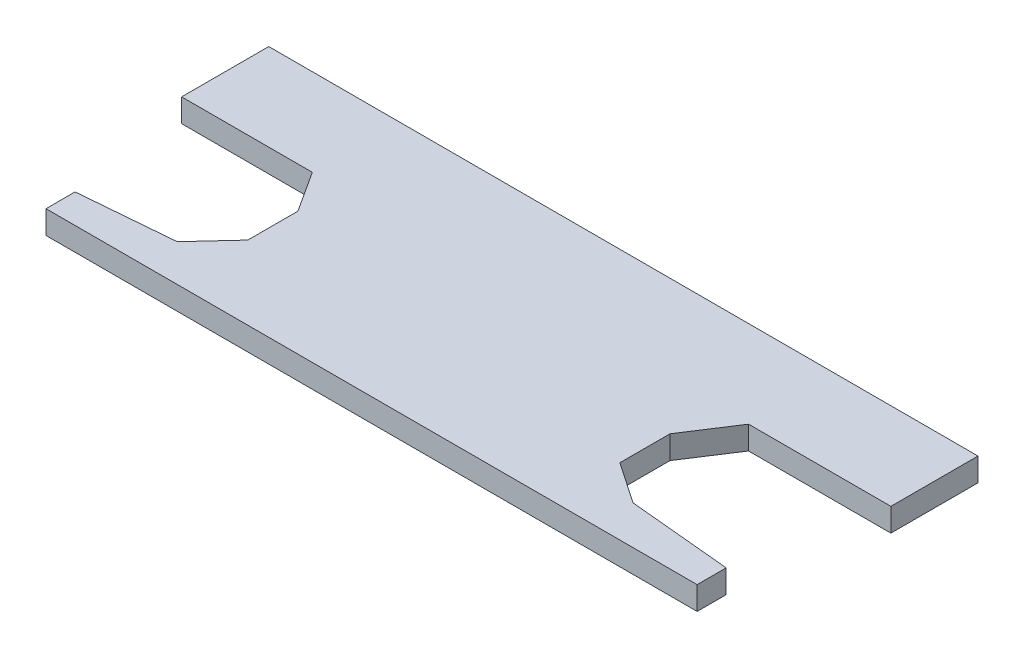
ISO-10303-21;
HEADER;
FILE_DESCRIPTION(('STEP AP214'),'2;1');
FILE_NAME('part.step','',(''),(''),'','','');
FILE_SCHEMA(('AUTOMOTIVE_DESIGN { 1 0 10303 214 1 1 1 1 }'));
ENDSEC;
DATA;
#1=APPLICATION_CONTEXT('core data for automotive mechanical design processes');
#2=APPLICATION_PROTOCOL_DEFINITION('international standard','automotive_design',2000,#1);
#3=PRODUCT_CONTEXT('',#1,'mechanical');
#4=PRODUCT('Part','Part','',(#3));
#5=PRODUCT_RELATED_PRODUCT_CATEGORY('part','',(#4));
#6=PRODUCT_DEFINITION_FORMATION('','',#4);
#7=PRODUCT_DEFINITION_CONTEXT('part definition',#1,'design');
#8=PRODUCT_DEFINITION('design','',#6,#7);
#9=PRODUCT_DEFINITION_SHAPE('','',#8);
#10=(LENGTH_UNIT() NAMED_UNIT(*) SI_UNIT(.MILLI.,.METRE.));
#11=(NAMED_UNIT(*) PLANE_ANGLE_UNIT() SI_UNIT($,.RADIAN.));
#12=(NAMED_UNIT(*) SI_UNIT($,.STERADIAN.) SOLID_ANGLE_UNIT());
#13=UNCERTAINTY_MEASURE_WITH_UNIT(LENGTH_MEASURE(1.E-05),#10,'distance_accuracy_value','');
#14=(GEOMETRIC_REPRESENTATION_CONTEXT(3) GLOBAL_UNCERTAINTY_ASSIGNED_CONTEXT((#13)) GLOBAL_UNIT_ASSIGNED_CONTEXT((#10,
#11,#12)) REPRESENTATION_CONTEXT('',''));
#15=CARTESIAN_POINT('',(0.,0.,0.));
#16=DIRECTION('',(0.,0.,1.));
#17=DIRECTION('',(1.,0.,0.));
#18=AXIS2_PLACEMENT_3D('',#15,#16,#17);
#19=CARTESIAN_POINT('',(0.,1.6,0.));
#20=DIRECTION('',(1.,0.,0.));
#21=DIRECTION('',(0.,0.,-1.));
#22=AXIS2_PLACEMENT_3D('',#19,#20,#21);
#23=PLANE('',#22);
#24=DIRECTION('',(0.,1.,0.));
#25=VECTOR('',#24,1.);
#26=CARTESIAN_POINT('',(0.,0.,-11.34));
#27=LINE('',#26,#25);
#28=CARTESIAN_POINT('',(0.,0.,-11.34));
#29=VERTEX_POINT('',#28);
#30=CARTESIAN_POINT('',(0.,1.6,-11.34));
#31=VERTEX_POINT('',#30);
#32=EDGE_CURVE('E194',#29,#31,#27,.T.);
#33=ORIENTED_EDGE('',*,*,#32,.T.);
#34=DIRECTION('',(0.,0.,1.));
#35=VECTOR('',#34,1.);
#36=CARTESIAN_POINT('',(0.,1.6,0.));
#37=LINE('',#36,#35);
#38=CARTESIAN_POINT('',(0.,1.6,-17.34));
#39=VERTEX_POINT('',#38);
#40=EDGE_CURVE('E252',#39,#31,#37,.T.);
#41=ORIENTED_EDGE('',*,*,#40,.F.);
#42=DIRECTION('',(0.,-1.,0.));
#43=VECTOR('',#42,1.);
#44=CARTESIAN_POINT('',(0.,1.6,-17.34));
#45=LINE('',#44,#43);
#46=CARTESIAN_POINT('',(0.,0.,-17.34));
#47=VERTEX_POINT('',#46);
#48=EDGE_CURVE('E41',#39,#47,#45,.T.);
#49=ORIENTED_EDGE('',*,*,#48,.T.);
#50=DIRECTION('',(0.,0.,1.));
#51=VECTOR('',#50,1.);
#52=CARTESIAN_POINT('',(0.,0.,0.));
#53=LINE('',#52,#51);
#54=EDGE_CURVE('E240',#47,#29,#53,.T.);
#55=ORIENTED_EDGE('',*,*,#54,.T.);
#56=EDGE_LOOP('',(#33,#41,#49,#55));
#57=FACE_BOUND('',#56,.T.);
#58=ADVANCED_FACE('F34',(#57),#23,.F.);
#59=CARTESIAN_POINT('',(0.,1.6,0.));
#60=DIRECTION('',(0.,0.,-1.));
#61=DIRECTION('',(-1.,0.,0.));
#62=AXIS2_PLACEMENT_3D('',#59,#60,#61);
#63=PLANE('',#62);
#64=DIRECTION('',(1.,0.,0.));
#65=VECTOR('',#64,1.);
#66=CARTESIAN_POINT('',(0.,1.6,0.));
#67=LINE('',#66,#65);
#68=CARTESIAN_POINT('',(2.,1.6,0.));
#69=VERTEX_POINT('',#68);
#70=CARTESIAN_POINT('',(46.84,1.6,0.));
#71=VERTEX_POINT('',#70);
#72=EDGE_CURVE('E255',#69,#71,#67,.T.);
#73=ORIENTED_EDGE('',*,*,#72,.F.);
#74=DIRECTION('',(0.,1.,0.));
#75=VECTOR('',#74,1.);
#76=CARTESIAN_POINT('',(2.,0.,0.));
#77=LINE('',#76,#75);
#78=CARTESIAN_POINT('',(2.,0.,0.));
#79=VERTEX_POINT('',#78);
#80=EDGE_CURVE('E191',#79,#69,#77,.T.);
#81=ORIENTED_EDGE('',*,*,#80,.F.);
#82=DIRECTION('',(1.,0.,0.));
#83=VECTOR('',#82,1.);
#84=CARTESIAN_POINT('',(0.,0.,0.));
#85=LINE('',#84,#83);
#86=CARTESIAN_POINT('',(46.84,0.,0.));
#87=VERTEX_POINT('',#86);
#88=EDGE_CURVE('E167',#79,#87,#85,.T.);
#89=ORIENTED_EDGE('',*,*,#88,.T.);
#90=DIRECTION('',(0.,1.,0.));
#91=VECTOR('',#90,1.);
#92=CARTESIAN_POINT('',(46.84,0.,0.));
#93=LINE('',#92,#91);
#94=EDGE_CURVE('E247',#87,#71,#93,.T.);
#95=ORIENTED_EDGE('',*,*,#94,.T.);
#96=EDGE_LOOP('',(#73,#81,#89,#95));
#97=FACE_BOUND('',#96,.T.);
#98=ADVANCED_FACE('F324',(#97),#63,.F.);
#99=CARTESIAN_POINT('',(48.84,1.6,0.));
#100=DIRECTION('',(-1.,0.,0.));
#101=DIRECTION('',(0.,0.,1.));
#102=AXIS2_PLACEMENT_3D('',#99,#100,#101);
#103=PLANE('',#102);
#104=DIRECTION('',(0.,0.,-1.));
#105=VECTOR('',#104,1.);
#106=CARTESIAN_POINT('',(48.84,1.6,0.));
#107=LINE('',#106,#105);
#108=CARTESIAN_POINT('',(48.84,1.6,-11.34));
#109=VERTEX_POINT('',#108);
#110=CARTESIAN_POINT('',(48.84,1.6,-17.34));
#111=VERTEX_POINT('',#110);
#112=EDGE_CURVE('E258',#109,#111,#107,.T.);
#113=ORIENTED_EDGE('',*,*,#112,.F.);
#114=DIRECTION('',(0.,1.,0.));
#115=VECTOR('',#114,1.);
#116=CARTESIAN_POINT('',(48.84,0.,-11.34));
#117=LINE('',#116,#115);
#118=CARTESIAN_POINT('',(48.84,0.,-11.34));
#119=VERTEX_POINT('',#118);
#120=EDGE_CURVE('E245',#119,#109,#117,.T.);
#121=ORIENTED_EDGE('',*,*,#120,.F.);
#122=DIRECTION('',(0.,0.,-1.));
#123=VECTOR('',#122,1.);
#124=CARTESIAN_POINT('',(48.84,0.,0.));
#125=LINE('',#124,#123);
#126=CARTESIAN_POINT('',(48.84,0.,-17.34));
#127=VERTEX_POINT('',#126);
#128=EDGE_CURVE('E265',#119,#127,#125,.T.);
#129=ORIENTED_EDGE('',*,*,#128,.T.);
#130=DIRECTION('',(0.,-1.,0.));
#131=VECTOR('',#130,1.);
#132=CARTESIAN_POINT('',(48.84,1.6,-17.34));
#133=LINE('',#132,#131);
#134=EDGE_CURVE('E11',#111,#127,#133,.T.);
#135=ORIENTED_EDGE('',*,*,#134,.F.);
#136=EDGE_LOOP('',(#113,#121,#129,#135));
#137=FACE_BOUND('',#136,.T.);
#138=ADVANCED_FACE('F294',(#137),#103,.F.);
#139=CARTESIAN_POINT('',(0.,1.6,-17.34));
#140=DIRECTION('',(0.,0.,1.));
#141=DIRECTION('',(1.,0.,0.));
#142=AXIS2_PLACEMENT_3D('',#139,#140,#141);
#143=PLANE('',#142);
#144=DIRECTION('',(-1.,0.,0.));
#145=VECTOR('',#144,1.);
#146=CARTESIAN_POINT('',(0.,0.,-17.34));
#147=LINE('',#146,#145);
#148=EDGE_CURVE('E256',#127,#47,#147,.T.);
#149=ORIENTED_EDGE('',*,*,#148,.T.);
#150=ORIENTED_EDGE('',*,*,#48,.F.);
#151=DIRECTION('',(-1.,0.,0.));
#152=VECTOR('',#151,1.);
#153=CARTESIAN_POINT('',(0.,1.6,-17.34));
#154=LINE('',#153,#152);
#155=EDGE_CURVE('E260',#111,#39,#154,.T.);
#156=ORIENTED_EDGE('',*,*,#155,.F.);
#157=ORIENTED_EDGE('',*,*,#134,.T.);
#158=EDGE_LOOP('',(#149,#150,#156,#157));
#159=FACE_BOUND('',#158,.T.);
#160=ADVANCED_FACE('F292',(#159),#143,.F.);
#161=CARTESIAN_POINT('',(0.,1.6,0.));
#162=DIRECTION('',(0.,-1.,0.));
#163=DIRECTION('',(0.,0.,-1.));
#164=AXIS2_PLACEMENT_3D('',#161,#162,#163);
#165=PLANE('',#164);
#166=DIRECTION('',(0.996424453394045,0.,-0.0844885121089164));
#167=VECTOR('',#166,1.);
#168=CARTESIAN_POINT('',(-0.154096221635649,1.6,-1.81735054365084));
#169=LINE('',#168,#167);
#170=CARTESIAN_POINT('',(2.,1.6,-2.));
#171=VERTEX_POINT('',#170);
#172=CARTESIAN_POINT('',(8.48648479760467,1.6,-2.55));
#173=VERTEX_POINT('',#172);
#174=EDGE_CURVE('E181',#171,#173,#169,.T.);
#175=ORIENTED_EDGE('',*,*,#174,.F.);
#176=DIRECTION('',(0.,0.,-1.));
#177=VECTOR('',#176,1.);
#178=CARTESIAN_POINT('',(2.,1.6,0.));
#179=LINE('',#178,#177);
#180=EDGE_CURVE('E153',#69,#171,#179,.T.);
#181=ORIENTED_EDGE('',*,*,#180,.F.);
#182=ORIENTED_EDGE('',*,*,#72,.T.);
#183=DIRECTION('',(0.,0.,-1.));
#184=VECTOR('',#183,1.);
#185=CARTESIAN_POINT('',(46.84,1.6,0.));
#186=LINE('',#185,#184);
#187=CARTESIAN_POINT('',(46.84,1.6,-2.));
#188=VERTEX_POINT('',#187);
#189=EDGE_CURVE('E227',#71,#188,#186,.T.);
#190=ORIENTED_EDGE('',*,*,#189,.T.);
#191=DIRECTION('',(0.995564595406087,0.,0.0940804781764742));
#192=VECTOR('',#191,1.);
#193=CARTESIAN_POINT('',(0.601913614136878,1.6,-6.36948169633607));
#194=LINE('',#193,#192);
#195=CARTESIAN_POINT('',(39.7500245677867,1.6,-2.67));
#196=VERTEX_POINT('',#195);
#197=EDGE_CURVE('E225',#196,#188,#194,.T.);
#198=ORIENTED_EDGE('',*,*,#197,.F.);
#199=DIRECTION('',(0.825588537147306,0.,0.564272600195129));
#200=VECTOR('',#199,1.);
#201=CARTESIAN_POINT('',(13.9003877886386,1.6,-20.3376892945608));
#202=LINE('',#201,#200);
#203=CARTESIAN_POINT('',(36.91,1.6,-4.61109774467124));
#204=VERTEX_POINT('',#203);
#205=EDGE_CURVE('E193',#204,#196,#202,.T.);
#206=ORIENTED_EDGE('',*,*,#205,.F.);
#207=DIRECTION('',(0.,0.,1.));
#208=VECTOR('',#207,1.);
#209=CARTESIAN_POINT('',(36.91,1.6,0.));
#210=LINE('',#209,#208);
#211=CARTESIAN_POINT('',(36.91,1.6,-8.06109774467124));
#212=VERTEX_POINT('',#211);
#213=EDGE_CURVE('E208',#212,#204,#210,.T.);
#214=ORIENTED_EDGE('',*,*,#213,.F.);
#215=DIRECTION('',(-0.544757033248082,0.,0.838593927194055));
#216=VECTOR('',#215,1.);
#217=CARTESIAN_POINT('',(22.2740292871147,1.6,14.469379898242));
#218=LINE('',#217,#216);
#219=CARTESIAN_POINT('',(39.04,1.6,-11.34));
#220=VERTEX_POINT('',#219);
#221=EDGE_CURVE('E233',#220,#212,#218,.T.);
#222=ORIENTED_EDGE('',*,*,#221,.F.);
#223=DIRECTION('',(-1.,0.,0.));
#224=VECTOR('',#223,1.);
#225=CARTESIAN_POINT('',(0.,1.6,-11.34));
#226=LINE('',#225,#224);
#227=EDGE_CURVE('E230',#109,#220,#226,.T.);
#228=ORIENTED_EDGE('',*,*,#227,.F.);
#229=ORIENTED_EDGE('',*,*,#112,.T.);
#230=ORIENTED_EDGE('',*,*,#155,.T.);
#231=ORIENTED_EDGE('',*,*,#40,.T.);
#232=DIRECTION('',(1.,0.,0.));
#233=VECTOR('',#232,1.);
#234=CARTESIAN_POINT('',(0.,1.6,-11.34));
#235=LINE('',#234,#233);
#236=CARTESIAN_POINT('',(9.,1.6,-11.34));
#237=VERTEX_POINT('',#236);
#238=EDGE_CURVE('E168',#31,#237,#235,.T.);
#239=ORIENTED_EDGE('',*,*,#238,.T.);
#240=DIRECTION('',(0.543283582089552,0.,0.839549253726036));
#241=VECTOR('',#240,1.);
#242=CARTESIAN_POINT('',(11.515911660649,1.6,-7.45210088658577));
#243=LINE('',#242,#241);
#244=CARTESIAN_POINT('',(10.82,1.6,-8.52751000001778));
#245=VERTEX_POINT('',#244);
#246=EDGE_CURVE('E171',#237,#245,#243,.T.);
#247=ORIENTED_EDGE('',*,*,#246,.T.);
#248=DIRECTION('',(0.,0.,1.));
#249=VECTOR('',#248,1.);
#250=CARTESIAN_POINT('',(10.82,1.6,0.));
#251=LINE('',#250,#249);
#252=CARTESIAN_POINT('',(10.82,1.6,-5.07751000001778));
#253=VERTEX_POINT('',#252);
#254=EDGE_CURVE('E186',#245,#253,#251,.T.);
#255=ORIENTED_EDGE('',*,*,#254,.T.);
#256=DIRECTION('',(-0.678347442556782,0.,0.734741279074936));
#257=VECTOR('',#256,1.);
#258=CARTESIAN_POINT('',(3.31043907759805,1.6,3.0563518696758));
#259=LINE('',#258,#257);
#260=EDGE_CURVE('E183',#253,#173,#259,.T.);
#261=ORIENTED_EDGE('',*,*,#260,.T.);
#262=EDGE_LOOP('',(#175,#181,#182,#190,#198,#206,#214,#222,#228,#229,#230,#231,#239,#247,#255,#261));
#263=FACE_BOUND('',#262,.T.);
#264=ADVANCED_FACE('F288',(#263),#165,.F.);
#265=CARTESIAN_POINT('',(0.,0.,0.));
#266=DIRECTION('',(0.,-1.,0.));
#267=DIRECTION('',(0.,0.,-1.));
#268=AXIS2_PLACEMENT_3D('',#265,#266,#267);
#269=PLANE('',#268);
#270=DIRECTION('',(0.,0.,-1.));
#271=VECTOR('',#270,1.);
#272=CARTESIAN_POINT('',(2.,0.,0.));
#273=LINE('',#272,#271);
#274=CARTESIAN_POINT('',(2.,0.,-2.));
#275=VERTEX_POINT('',#274);
#276=EDGE_CURVE('E150',#79,#275,#273,.T.);
#277=ORIENTED_EDGE('',*,*,#276,.T.);
#278=DIRECTION('',(0.996424453394045,0.,-0.0844885121089164));
#279=VECTOR('',#278,1.);
#280=CARTESIAN_POINT('',(-0.154096221635649,0.,-1.81735054365084));
#281=LINE('',#280,#279);
#282=CARTESIAN_POINT('',(8.48648479760467,0.,-2.55));
#283=VERTEX_POINT('',#282);
#284=EDGE_CURVE('E158',#275,#283,#281,.T.);
#285=ORIENTED_EDGE('',*,*,#284,.T.);
#286=DIRECTION('',(-0.678347442556782,0.,0.734741279074936));
#287=VECTOR('',#286,1.);
#288=CARTESIAN_POINT('',(3.31043907759805,0.,3.0563518696758));
#289=LINE('',#288,#287);
#290=CARTESIAN_POINT('',(10.82,0.,-5.07751000001778));
#291=VERTEX_POINT('',#290);
#292=EDGE_CURVE('E162',#291,#283,#289,.T.);
#293=ORIENTED_EDGE('',*,*,#292,.F.);
#294=DIRECTION('',(0.,0.,1.));
#295=VECTOR('',#294,1.);
#296=CARTESIAN_POINT('',(10.82,0.,0.));
#297=LINE('',#296,#295);
#298=CARTESIAN_POINT('',(10.82,0.,-8.52751000001778));
#299=VERTEX_POINT('',#298);
#300=EDGE_CURVE('E175',#299,#291,#297,.T.);
#301=ORIENTED_EDGE('',*,*,#300,.F.);
#302=DIRECTION('',(0.543283582089552,0.,0.839549253726036));
#303=VECTOR('',#302,1.);
#304=CARTESIAN_POINT('',(11.515911660649,0.,-7.45210088658577));
#305=LINE('',#304,#303);
#306=CARTESIAN_POINT('',(9.,0.,-11.34));
#307=VERTEX_POINT('',#306);
#308=EDGE_CURVE('E177',#307,#299,#305,.T.);
#309=ORIENTED_EDGE('',*,*,#308,.F.);
#310=DIRECTION('',(1.,0.,0.));
#311=VECTOR('',#310,1.);
#312=CARTESIAN_POINT('',(0.,0.,-11.34));
#313=LINE('',#312,#311);
#314=EDGE_CURVE('E155',#29,#307,#313,.T.);
#315=ORIENTED_EDGE('',*,*,#314,.F.);
#316=ORIENTED_EDGE('',*,*,#54,.F.);
#317=ORIENTED_EDGE('',*,*,#148,.F.);
#318=ORIENTED_EDGE('',*,*,#128,.F.);
#319=DIRECTION('',(-1.,0.,0.));
#320=VECTOR('',#319,1.);
#321=CARTESIAN_POINT('',(0.,0.,-11.34));
#322=LINE('',#321,#320);
#323=CARTESIAN_POINT('',(39.04,0.,-11.34));
#324=VERTEX_POINT('',#323);
#325=EDGE_CURVE('E213',#119,#324,#322,.T.);
#326=ORIENTED_EDGE('',*,*,#325,.T.);
#327=DIRECTION('',(-0.544757033248082,0.,0.838593927194055));
#328=VECTOR('',#327,1.);
#329=CARTESIAN_POINT('',(22.2740292871147,0.,14.469379898242));
#330=LINE('',#329,#328);
#331=CARTESIAN_POINT('',(36.91,0.,-8.06109774467124));
#332=VERTEX_POINT('',#331);
#333=EDGE_CURVE('E216',#324,#332,#330,.T.);
#334=ORIENTED_EDGE('',*,*,#333,.T.);
#335=DIRECTION('',(0.,0.,1.));
#336=VECTOR('',#335,1.);
#337=CARTESIAN_POINT('',(36.91,0.,0.));
#338=LINE('',#337,#336);
#339=CARTESIAN_POINT('',(36.91,0.,-4.61109774467124));
#340=VERTEX_POINT('',#339);
#341=EDGE_CURVE('E219',#332,#340,#338,.T.);
#342=ORIENTED_EDGE('',*,*,#341,.T.);
#343=DIRECTION('',(0.825588537147306,0.,0.564272600195129));
#344=VECTOR('',#343,1.);
#345=CARTESIAN_POINT('',(13.9003877886386,0.,-20.3376892945608));
#346=LINE('',#345,#344);
#347=CARTESIAN_POINT('',(39.7500245677867,0.,-2.67));
#348=VERTEX_POINT('',#347);
#349=EDGE_CURVE('E204',#340,#348,#346,.T.);
#350=ORIENTED_EDGE('',*,*,#349,.T.);
#351=DIRECTION('',(0.995564595406087,0.,0.0940804781764742));
#352=VECTOR('',#351,1.);
#353=CARTESIAN_POINT('',(0.601913614136878,0.,-6.36948169633607));
#354=LINE('',#353,#352);
#355=CARTESIAN_POINT('',(46.84,0.,-2.));
#356=VERTEX_POINT('',#355);
#357=EDGE_CURVE('E207',#348,#356,#354,.T.);
#358=ORIENTED_EDGE('',*,*,#357,.T.);
#359=DIRECTION('',(0.,0.,-1.));
#360=VECTOR('',#359,1.);
#361=CARTESIAN_POINT('',(46.84,0.,0.));
#362=LINE('',#361,#360);
#363=EDGE_CURVE('E211',#87,#356,#362,.T.);
#364=ORIENTED_EDGE('',*,*,#363,.F.);
#365=ORIENTED_EDGE('',*,*,#88,.F.);
#366=EDGE_LOOP('',(#277,#285,#293,#301,#309,#315,#316,#317,#318,#326,#334,#342,#350,#358,#364,#365));
#367=FACE_BOUND('',#366,.T.);
#368=ADVANCED_FACE('F165',(#367),#269,.T.);
#369=CARTESIAN_POINT('',(13.9003877886386,0.,-20.3376892945608));
#370=DIRECTION('',(-0.564272600195129,0.,0.825588537147305));
#371=DIRECTION('',(0.825588537147306,0.,0.564272600195129));
#372=AXIS2_PLACEMENT_3D('',#369,#370,#371);
#373=PLANE('',#372);
#374=ORIENTED_EDGE('',*,*,#205,.T.);
#375=DIRECTION('',(0.,1.,0.));
#376=VECTOR('',#375,1.);
#377=CARTESIAN_POINT('',(39.7500245677867,0.,-2.67));
#378=LINE('',#377,#376);
#379=EDGE_CURVE('E222',#348,#196,#378,.T.);
#380=ORIENTED_EDGE('',*,*,#379,.F.);
#381=ORIENTED_EDGE('',*,*,#349,.F.);
#382=DIRECTION('',(0.,1.,0.));
#383=VECTOR('',#382,1.);
#384=CARTESIAN_POINT('',(36.91,0.,-4.61109774467124));
#385=LINE('',#384,#383);
#386=EDGE_CURVE('E238',#340,#204,#385,.T.);
#387=ORIENTED_EDGE('',*,*,#386,.T.);
#388=EDGE_LOOP('',(#374,#380,#381,#387));
#389=FACE_BOUND('',#388,.T.);
#390=ADVANCED_FACE('F308',(#389),#373,.F.);
#391=CARTESIAN_POINT('',(36.91,0.,0.));
#392=DIRECTION('',(-1.,0.,0.));
#393=DIRECTION('',(0.,0.,1.));
#394=AXIS2_PLACEMENT_3D('',#391,#392,#393);
#395=PLANE('',#394);
#396=ORIENTED_EDGE('',*,*,#213,.T.);
#397=ORIENTED_EDGE('',*,*,#386,.F.);
#398=ORIENTED_EDGE('',*,*,#341,.F.);
#399=DIRECTION('',(0.,1.,0.));
#400=VECTOR('',#399,1.);
#401=CARTESIAN_POINT('',(36.91,0.,-8.06109774467124));
#402=LINE('',#401,#400);
#403=EDGE_CURVE('E241',#332,#212,#402,.T.);
#404=ORIENTED_EDGE('',*,*,#403,.T.);
#405=EDGE_LOOP('',(#396,#397,#398,#404));
#406=FACE_BOUND('',#405,.T.);
#407=ADVANCED_FACE('F305',(#406),#395,.F.);
#408=CARTESIAN_POINT('',(22.2740292871147,0.,14.469379898242));
#409=DIRECTION('',(-0.838593927194055,0.,-0.544757033248082));
#410=DIRECTION('',(-0.544757033248082,0.,0.838593927194055));
#411=AXIS2_PLACEMENT_3D('',#408,#409,#410);
#412=PLANE('',#411);
#413=ORIENTED_EDGE('',*,*,#221,.T.);
#414=ORIENTED_EDGE('',*,*,#403,.F.);
#415=ORIENTED_EDGE('',*,*,#333,.F.);
#416=DIRECTION('',(0.,1.,0.));
#417=VECTOR('',#416,1.);
#418=CARTESIAN_POINT('',(39.04,0.,-11.34));
#419=LINE('',#418,#417);
#420=EDGE_CURVE('E243',#324,#220,#419,.T.);
#421=ORIENTED_EDGE('',*,*,#420,.T.);
#422=EDGE_LOOP('',(#413,#414,#415,#421));
#423=FACE_BOUND('',#422,.T.);
#424=ADVANCED_FACE('F301',(#423),#412,.F.);
#425=CARTESIAN_POINT('',(0.,0.,-11.34));
#426=DIRECTION('',(0.,0.,-1.));
#427=DIRECTION('',(-1.,0.,0.));
#428=AXIS2_PLACEMENT_3D('',#425,#426,#427);
#429=PLANE('',#428);
#430=ORIENTED_EDGE('',*,*,#227,.T.);
#431=ORIENTED_EDGE('',*,*,#420,.F.);
#432=ORIENTED_EDGE('',*,*,#325,.F.);
#433=ORIENTED_EDGE('',*,*,#120,.T.);
#434=EDGE_LOOP('',(#430,#431,#432,#433));
#435=FACE_BOUND('',#434,.T.);
#436=ADVANCED_FACE('F298',(#435),#429,.F.);
#437=CARTESIAN_POINT('',(46.84,0.,0.));
#438=DIRECTION('',(1.,0.,0.));
#439=DIRECTION('',(0.,0.,-1.));
#440=AXIS2_PLACEMENT_3D('',#437,#438,#439);
#441=PLANE('',#440);
#442=ORIENTED_EDGE('',*,*,#189,.F.);
#443=ORIENTED_EDGE('',*,*,#94,.F.);
#444=ORIENTED_EDGE('',*,*,#363,.T.);
#445=DIRECTION('',(0.,1.,0.));
#446=VECTOR('',#445,1.);
#447=CARTESIAN_POINT('',(46.84,0.,-2.));
#448=LINE('',#447,#446);
#449=EDGE_CURVE('E56',#356,#188,#448,.T.);
#450=ORIENTED_EDGE('',*,*,#449,.T.);
#451=EDGE_LOOP('',(#442,#443,#444,#450));
#452=FACE_BOUND('',#451,.T.);
#453=ADVANCED_FACE('F313',(#452),#441,.T.);
#454=CARTESIAN_POINT('',(0.601913614136878,0.,-6.36948169633607));
#455=DIRECTION('',(-0.0940804781764741,0.,0.995564595406087));
#456=DIRECTION('',(0.995564595406087,0.,0.0940804781764742));
#457=AXIS2_PLACEMENT_3D('',#454,#455,#456);
#458=PLANE('',#457);
#459=ORIENTED_EDGE('',*,*,#197,.T.);
#460=ORIENTED_EDGE('',*,*,#449,.F.);
#461=ORIENTED_EDGE('',*,*,#357,.F.);
#462=ORIENTED_EDGE('',*,*,#379,.T.);
#463=EDGE_LOOP('',(#459,#460,#461,#462));
#464=FACE_BOUND('',#463,.T.);
#465=ADVANCED_FACE('F311',(#464),#458,.F.);
#466=CARTESIAN_POINT('',(2.,0.,0.));
#467=DIRECTION('',(1.,0.,0.));
#468=DIRECTION('',(0.,0.,-1.));
#469=AXIS2_PLACEMENT_3D('',#466,#467,#468);
#470=PLANE('',#469);
#471=ORIENTED_EDGE('',*,*,#180,.T.);
#472=DIRECTION('',(0.,1.,0.));
#473=VECTOR('',#472,1.);
#474=CARTESIAN_POINT('',(2.,0.,-2.));
#475=LINE('',#474,#473);
#476=EDGE_CURVE('E147',#275,#171,#475,.T.);
#477=ORIENTED_EDGE('',*,*,#476,.F.);
#478=ORIENTED_EDGE('',*,*,#276,.F.);
#479=ORIENTED_EDGE('',*,*,#80,.T.);
#480=EDGE_LOOP('',(#471,#477,#478,#479));
#481=FACE_BOUND('',#480,.T.);
#482=ADVANCED_FACE('F148',(#481),#470,.F.);
#483=CARTESIAN_POINT('',(0.,0.,-11.34));
#484=DIRECTION('',(0.,0.,1.));
#485=DIRECTION('',(1.,0.,0.));
#486=AXIS2_PLACEMENT_3D('',#483,#484,#485);
#487=PLANE('',#486);
#488=ORIENTED_EDGE('',*,*,#238,.F.);
#489=ORIENTED_EDGE('',*,*,#32,.F.);
#490=ORIENTED_EDGE('',*,*,#314,.T.);
#491=DIRECTION('',(0.,1.,0.));
#492=VECTOR('',#491,1.);
#493=CARTESIAN_POINT('',(9.,0.,-11.34));
#494=LINE('',#493,#492);
#495=EDGE_CURVE('E197',#307,#237,#494,.T.);
#496=ORIENTED_EDGE('',*,*,#495,.T.);
#497=EDGE_LOOP('',(#488,#489,#490,#496));
#498=FACE_BOUND('',#497,.T.);
#499=ADVANCED_FACE('F281',(#498),#487,.T.);
#500=CARTESIAN_POINT('',(11.515911660649,0.,-7.45210088658577));
#501=DIRECTION('',(-0.839549253726037,0.,0.543283582089552));
#502=DIRECTION('',(0.543283582089552,0.,0.839549253726037));
#503=AXIS2_PLACEMENT_3D('',#500,#501,#502);
#504=PLANE('',#503);
#505=ORIENTED_EDGE('',*,*,#246,.F.);
#506=ORIENTED_EDGE('',*,*,#495,.F.);
#507=ORIENTED_EDGE('',*,*,#308,.T.);
#508=DIRECTION('',(0.,1.,0.));
#509=VECTOR('',#508,1.);
#510=CARTESIAN_POINT('',(10.82,0.,-8.52751000001778));
#511=LINE('',#510,#509);
#512=EDGE_CURVE('E199',#299,#245,#511,.T.);
#513=ORIENTED_EDGE('',*,*,#512,.T.);
#514=EDGE_LOOP('',(#505,#506,#507,#513));
#515=FACE_BOUND('',#514,.T.);
#516=ADVANCED_FACE('F284',(#515),#504,.T.);
#517=CARTESIAN_POINT('',(10.82,0.,0.));
#518=DIRECTION('',(-1.,0.,0.));
#519=DIRECTION('',(0.,0.,1.));
#520=AXIS2_PLACEMENT_3D('',#517,#518,#519);
#521=PLANE('',#520);
#522=ORIENTED_EDGE('',*,*,#254,.F.);
#523=ORIENTED_EDGE('',*,*,#512,.F.);
#524=ORIENTED_EDGE('',*,*,#300,.T.);
#525=DIRECTION('',(0.,1.,0.));
#526=VECTOR('',#525,1.);
#527=CARTESIAN_POINT('',(10.82,0.,-5.07751000001778));
#528=LINE('',#527,#526);
#529=EDGE_CURVE('E201',#291,#253,#528,.T.);
#530=ORIENTED_EDGE('',*,*,#529,.T.);
#531=EDGE_LOOP('',(#522,#523,#524,#530));
#532=FACE_BOUND('',#531,.T.);
#533=ADVANCED_FACE('F429',(#532),#521,.T.);
#534=CARTESIAN_POINT('',(3.31043907759805,0.,3.0563518696758));
#535=DIRECTION('',(-0.734741279074936,0.,-0.678347442556782));
#536=DIRECTION('',(-0.678347442556782,0.,0.734741279074936));
#537=AXIS2_PLACEMENT_3D('',#534,#535,#536);
#538=PLANE('',#537);
#539=ORIENTED_EDGE('',*,*,#260,.F.);
#540=ORIENTED_EDGE('',*,*,#529,.F.);
#541=ORIENTED_EDGE('',*,*,#292,.T.);
#542=DIRECTION('',(0.,1.,0.));
#543=VECTOR('',#542,1.);
#544=CARTESIAN_POINT('',(8.48648479760467,0.,-2.55));
#545=LINE('',#544,#543);
#546=EDGE_CURVE('E48',#283,#173,#545,.T.);
#547=ORIENTED_EDGE('',*,*,#546,.T.);
#548=EDGE_LOOP('',(#539,#540,#541,#547));
#549=FACE_BOUND('',#548,.T.);
#550=ADVANCED_FACE('F438',(#549),#538,.T.);
#551=CARTESIAN_POINT('',(-0.154096221635649,0.,-1.81735054365084));
#552=DIRECTION('',(0.0844885121089164,0.,0.996424453394045));
#553=DIRECTION('',(0.996424453394045,0.,-0.0844885121089164));
#554=AXIS2_PLACEMENT_3D('',#551,#552,#553);
#555=PLANE('',#554);
#556=ORIENTED_EDGE('',*,*,#174,.T.);
#557=ORIENTED_EDGE('',*,*,#546,.F.);
#558=ORIENTED_EDGE('',*,*,#284,.F.);
#559=ORIENTED_EDGE('',*,*,#476,.T.);
#560=EDGE_LOOP('',(#556,#557,#558,#559));
#561=FACE_BOUND('',#560,.T.);
#562=ADVANCED_FACE('F159',(#561),#555,.F.);
#563=CLOSED_SHELL('',(#58,#98,#138,#160,#264,#368,#390,#407,#424,#436,#453,#465,#482,#499,#516,
#533,#550,#562));
#564=MANIFOLD_SOLID_BREP('B2',#563);
#565=ADVANCED_BREP_SHAPE_REPRESENTATION('',(#18,#564),#14);
#566=SHAPE_DEFINITION_REPRESENTATION(#9,#565);
ENDSEC;
END-ISO-10303-21;
